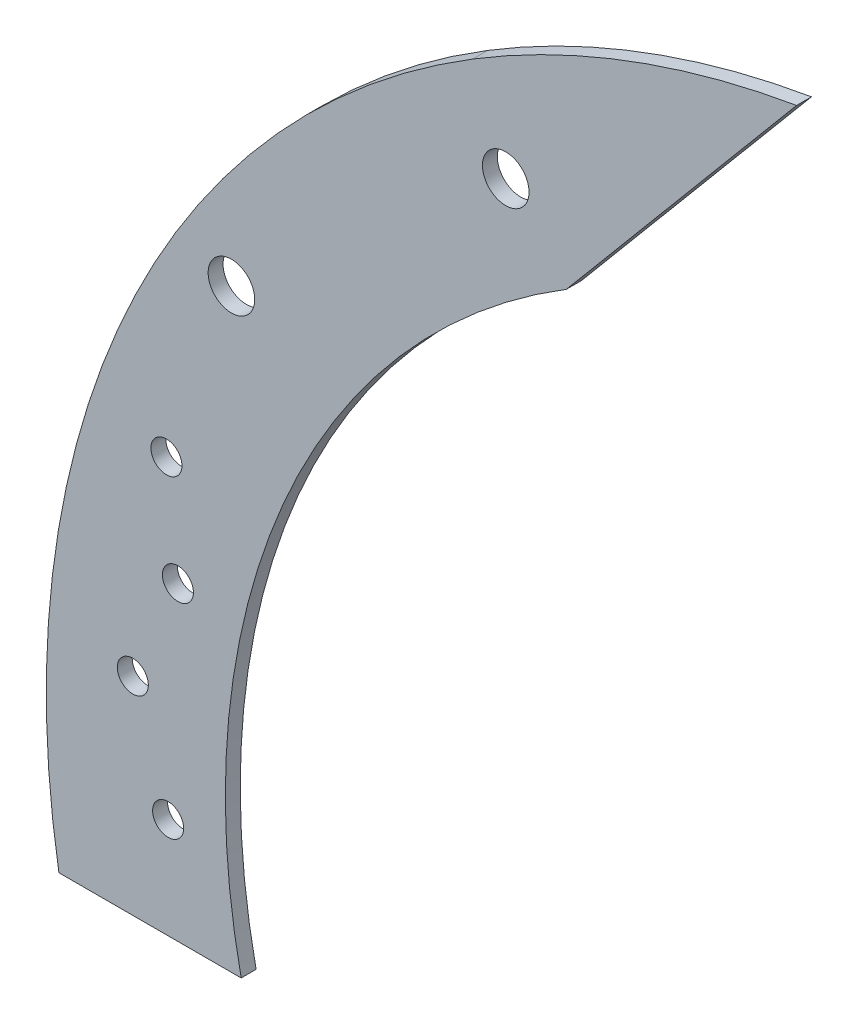
ISO-10303-21;
HEADER;
FILE_DESCRIPTION(('STEP AP214'),'2;1');
FILE_NAME('part.step','',(''),(''),'','','');
FILE_SCHEMA(('AUTOMOTIVE_DESIGN { 1 0 10303 214 1 1 1 1 }'));
ENDSEC;
DATA;
#1=APPLICATION_CONTEXT('core data for automotive mechanical design processes');
#2=APPLICATION_PROTOCOL_DEFINITION('international standard','automotive_design',2000,#1);
#3=PRODUCT_CONTEXT('',#1,'mechanical');
#4=PRODUCT('Part','Part','',(#3));
#5=PRODUCT_RELATED_PRODUCT_CATEGORY('part','',(#4));
#6=PRODUCT_DEFINITION_FORMATION('','',#4);
#7=PRODUCT_DEFINITION_CONTEXT('part definition',#1,'design');
#8=PRODUCT_DEFINITION('design','',#6,#7);
#9=PRODUCT_DEFINITION_SHAPE('','',#8);
#10=(LENGTH_UNIT() NAMED_UNIT(*) SI_UNIT(.MILLI.,.METRE.));
#11=(NAMED_UNIT(*) PLANE_ANGLE_UNIT() SI_UNIT($,.RADIAN.));
#12=(NAMED_UNIT(*) SI_UNIT($,.STERADIAN.) SOLID_ANGLE_UNIT());
#13=UNCERTAINTY_MEASURE_WITH_UNIT(LENGTH_MEASURE(1.E-05),#10,'distance_accuracy_value','');
#14=(GEOMETRIC_REPRESENTATION_CONTEXT(3) GLOBAL_UNCERTAINTY_ASSIGNED_CONTEXT((#13)) GLOBAL_UNIT_ASSIGNED_CONTEXT((#10,
#11,#12)) REPRESENTATION_CONTEXT('',''));
#15=CARTESIAN_POINT('',(0.,0.,0.));
#16=DIRECTION('',(0.,0.,1.));
#17=DIRECTION('',(1.,0.,0.));
#18=AXIS2_PLACEMENT_3D('',#15,#16,#17);
#19=CARTESIAN_POINT('',(-1.960372,-4.635754,3.175));
#20=DIRECTION('',(0.,0.,-1.));
#21=DIRECTION('',(-1.,0.,0.));
#22=AXIS2_PLACEMENT_3D('',#19,#20,#21);
#23=CYLINDRICAL_SURFACE('',#22,152.075409775388);
#24=CARTESIAN_POINT('',(-1.960372,-4.635754,0.));
#25=DIRECTION('',(0.,0.,-1.));
#26=DIRECTION('',(-1.,0.,0.));
#27=AXIS2_PLACEMENT_3D('',#24,#25,#26);
#28=CIRCLE('',#27,152.075409775388);
#29=CARTESIAN_POINT('',(-150.657390540399,-36.5125,0.));
#30=VERTEX_POINT('',#29);
#31=CARTESIAN_POINT('',(-81.4491978882218,125.011678744595,0.));
#32=VERTEX_POINT('',#31);
#33=EDGE_CURVE('E107',#30,#32,#28,.T.);
#34=ORIENTED_EDGE('',*,*,#33,.T.);
#35=DIRECTION('',(0.,0.,-1.));
#36=VECTOR('',#35,1.);
#37=CARTESIAN_POINT('',(-81.4491978882218,125.011678744595,3.175));
#38=LINE('',#37,#36);
#39=CARTESIAN_POINT('',(-81.4491978882218,125.011678744595,3.175));
#40=VERTEX_POINT('',#39);
#41=EDGE_CURVE('E11',#40,#32,#38,.T.);
#42=ORIENTED_EDGE('',*,*,#41,.F.);
#43=CARTESIAN_POINT('',(-1.960372,-4.635754,3.175));
#44=DIRECTION('',(0.,0.,-1.));
#45=DIRECTION('',(-1.,0.,0.));
#46=AXIS2_PLACEMENT_3D('',#43,#44,#45);
#47=CIRCLE('',#46,152.075409775388);
#48=CARTESIAN_POINT('',(-150.657390540399,-36.5125,3.175));
#49=VERTEX_POINT('',#48);
#50=EDGE_CURVE('E116',#49,#40,#47,.T.);
#51=ORIENTED_EDGE('',*,*,#50,.F.);
#52=DIRECTION('',(0.,0.,-1.));
#53=VECTOR('',#52,1.);
#54=CARTESIAN_POINT('',(-150.657390540399,-36.5125,3.175));
#55=LINE('',#54,#53);
#56=EDGE_CURVE('E103',#49,#30,#55,.T.);
#57=ORIENTED_EDGE('',*,*,#56,.T.);
#58=EDGE_LOOP('',(#34,#42,#51,#57));
#59=FACE_BOUND('',#58,.T.);
#60=ADVANCED_FACE('F33',(#59),#23,.F.);
#61=CARTESIAN_POINT('',(-81.4491978882218,125.011678744595,3.175));
#62=DIRECTION('',(-0.766044443118979,0.642787609686538,0.));
#63=DIRECTION('',(-0.642787609686538,-0.766044443118979,0.));
#64=AXIS2_PLACEMENT_3D('',#61,#62,#63);
#65=PLANE('',#64);
#66=DIRECTION('',(0.642787609686538,0.766044443118979,0.));
#67=VECTOR('',#66,1.);
#68=CARTESIAN_POINT('',(-81.4491978882218,125.011678744595,0.));
#69=LINE('',#68,#67);
#70=CARTESIAN_POINT('',(-32.4687820301075,183.384265310261,0.));
#71=VERTEX_POINT('',#70);
#72=EDGE_CURVE('E110',#32,#71,#69,.T.);
#73=ORIENTED_EDGE('',*,*,#72,.T.);
#74=DIRECTION('',(0.,0.,-1.));
#75=VECTOR('',#74,1.);
#76=CARTESIAN_POINT('',(-32.4687820301075,183.384265310261,3.175));
#77=LINE('',#76,#75);
#78=CARTESIAN_POINT('',(-32.4687820301075,183.384265310261,3.175));
#79=VERTEX_POINT('',#78);
#80=EDGE_CURVE('E41',#79,#71,#77,.T.);
#81=ORIENTED_EDGE('',*,*,#80,.F.);
#82=DIRECTION('',(0.642787609686538,0.766044443118979,0.));
#83=VECTOR('',#82,1.);
#84=CARTESIAN_POINT('',(-81.4491978882218,125.011678744595,3.175));
#85=LINE('',#84,#83);
#86=EDGE_CURVE('E83',#40,#79,#85,.T.);
#87=ORIENTED_EDGE('',*,*,#86,.F.);
#88=ORIENTED_EDGE('',*,*,#41,.T.);
#89=EDGE_LOOP('',(#73,#81,#87,#88));
#90=FACE_BOUND('',#89,.T.);
#91=ADVANCED_FACE('F137',(#90),#65,.F.);
#92=CARTESIAN_POINT('',(0.207299060866632,-8.17125707147935,3.175));
#93=DIRECTION('',(0.,0.,-1.));
#94=DIRECTION('',(-1.,0.,0.));
#95=AXIS2_PLACEMENT_3D('',#92,#93,#94);
#96=CYLINDRICAL_SURFACE('',#95,194.32252682179);
#97=CARTESIAN_POINT('',(0.207299060866632,-8.17125707147935,0.));
#98=DIRECTION('',(0.,0.,1.));
#99=DIRECTION('',(-1.,0.,0.));
#100=AXIS2_PLACEMENT_3D('',#97,#98,#99);
#101=CIRCLE('',#100,194.32252682179);
#102=CARTESIAN_POINT('',(-101.363819659176,157.49271690103,0.));
#103=VERTEX_POINT('',#102);
#104=EDGE_CURVE('E98',#71,#103,#101,.T.);
#105=ORIENTED_EDGE('',*,*,#104,.T.);
#106=DIRECTION('',(0.,0.,-1.));
#107=VECTOR('',#106,1.);
#108=CARTESIAN_POINT('',(-101.363819659176,157.49271690103,3.175));
#109=LINE('',#108,#107);
#110=CARTESIAN_POINT('',(-101.363819659176,157.49271690103,3.175));
#111=VERTEX_POINT('',#110);
#112=EDGE_CURVE('E95',#111,#103,#109,.T.);
#113=ORIENTED_EDGE('',*,*,#112,.F.);
#114=CARTESIAN_POINT('',(0.207299060866632,-8.17125707147935,3.175));
#115=DIRECTION('',(0.,0.,1.));
#116=DIRECTION('',(-1.,0.,0.));
#117=AXIS2_PLACEMENT_3D('',#114,#115,#116);
#118=CIRCLE('',#117,194.32252682179);
#119=EDGE_CURVE('E87',#79,#111,#118,.T.);
#120=ORIENTED_EDGE('',*,*,#119,.F.);
#121=ORIENTED_EDGE('',*,*,#80,.T.);
#122=EDGE_LOOP('',(#105,#113,#120,#121));
#123=FACE_BOUND('',#122,.T.);
#124=ADVANCED_FACE('F96',(#123),#96,.T.);
#125=CARTESIAN_POINT('',(-1.960372,-4.635754,3.175));
#126=DIRECTION('',(0.,0.,-1.));
#127=DIRECTION('',(-1.,0.,0.));
#128=AXIS2_PLACEMENT_3D('',#125,#126,#127);
#129=CYLINDRICAL_SURFACE('',#128,190.175409775388);
#130=CARTESIAN_POINT('',(-1.960372,-4.635754,0.));
#131=DIRECTION('',(0.,0.,1.));
#132=DIRECTION('',(-1.,0.,0.));
#133=AXIS2_PLACEMENT_3D('',#130,#131,#132);
#134=CIRCLE('',#133,190.175409775388);
#135=CARTESIAN_POINT('',(-189.445196846408,-36.5125,0.));
#136=VERTEX_POINT('',#135);
#137=EDGE_CURVE('E69',#103,#136,#134,.T.);
#138=ORIENTED_EDGE('',*,*,#137,.T.);
#139=DIRECTION('',(0.,0.,-1.));
#140=VECTOR('',#139,1.);
#141=CARTESIAN_POINT('',(-189.445196846408,-36.5125,3.175));
#142=LINE('',#141,#140);
#143=CARTESIAN_POINT('',(-189.445196846408,-36.5125,3.175));
#144=VERTEX_POINT('',#143);
#145=EDGE_CURVE('E99',#144,#136,#142,.T.);
#146=ORIENTED_EDGE('',*,*,#145,.F.);
#147=CARTESIAN_POINT('',(-1.960372,-4.635754,3.175));
#148=DIRECTION('',(0.,0.,1.));
#149=DIRECTION('',(-1.,0.,0.));
#150=AXIS2_PLACEMENT_3D('',#147,#148,#149);
#151=CIRCLE('',#150,190.175409775388);
#152=EDGE_CURVE('E91',#111,#144,#151,.T.);
#153=ORIENTED_EDGE('',*,*,#152,.F.);
#154=ORIENTED_EDGE('',*,*,#112,.T.);
#155=EDGE_LOOP('',(#138,#146,#153,#154));
#156=FACE_BOUND('',#155,.T.);
#157=ADVANCED_FACE('F101',(#156),#129,.T.);
#158=CARTESIAN_POINT('',(-150.657390540399,-36.5125,3.175));
#159=DIRECTION('',(0.,1.,0.));
#160=DIRECTION('',(0.,0.,1.));
#161=AXIS2_PLACEMENT_3D('',#158,#159,#160);
#162=PLANE('',#161);
#163=DIRECTION('',(1.,0.,0.));
#164=VECTOR('',#163,1.);
#165=CARTESIAN_POINT('',(-150.657390540399,-36.5125,0.));
#166=LINE('',#165,#164);
#167=EDGE_CURVE('E75',#136,#30,#166,.T.);
#168=ORIENTED_EDGE('',*,*,#167,.T.);
#169=ORIENTED_EDGE('',*,*,#56,.F.);
#170=DIRECTION('',(1.,0.,0.));
#171=VECTOR('',#170,1.);
#172=CARTESIAN_POINT('',(-150.657390540399,-36.5125,3.175));
#173=LINE('',#172,#171);
#174=EDGE_CURVE('E49',#144,#49,#173,.T.);
#175=ORIENTED_EDGE('',*,*,#174,.F.);
#176=ORIENTED_EDGE('',*,*,#145,.T.);
#177=EDGE_LOOP('',(#168,#169,#175,#176));
#178=FACE_BOUND('',#177,.T.);
#179=ADVANCED_FACE('F124',(#178),#162,.F.);
#180=CARTESIAN_POINT('',(-1.960372,-4.635754,3.175));
#181=DIRECTION('',(0.,0.,-1.));
#182=DIRECTION('',(-1.,0.,0.));
#183=AXIS2_PLACEMENT_3D('',#180,#181,#182);
#184=PLANE('',#183);
#185=CARTESIAN_POINT('',(-94.3609261196445,138.934265310261,3.175));
#186=DIRECTION('',(0.,0.,1.));
#187=DIRECTION('',(1.,0.,0.));
#188=AXIS2_PLACEMENT_3D('',#185,#186,#187);
#189=CIRCLE('',#188,4.96100099999999);
#190=CARTESIAN_POINT('',(-89.3999251196445,138.934265310261,3.175));
#191=VERTEX_POINT('',#190);
#192=EDGE_CURVE('E234',#191,#191,#189,.T.);
#193=ORIENTED_EDGE('',*,*,#192,.F.);
#194=EDGE_LOOP('',(#193));
#195=FACE_BOUND('',#194,.T.);
#196=CARTESIAN_POINT('',(-152.73351268531,89.9538494521462,3.175));
#197=DIRECTION('',(0.,0.,1.));
#198=DIRECTION('',(1.,0.,0.));
#199=AXIS2_PLACEMENT_3D('',#196,#197,#198);
#200=CIRCLE('',#199,4.96100099999999);
#201=CARTESIAN_POINT('',(-147.77251168531,89.9538494521462,3.175));
#202=VERTEX_POINT('',#201);
#203=EDGE_CURVE('E236',#202,#202,#200,.T.);
#204=ORIENTED_EDGE('',*,*,#203,.F.);
#205=EDGE_LOOP('',(#204));
#206=FACE_BOUND('',#205,.T.);
#207=CARTESIAN_POINT('',(-173.718655591782,7.57955745237717,3.175));
#208=DIRECTION('',(0.,0.,1.));
#209=DIRECTION('',(1.,0.,0.));
#210=AXIS2_PLACEMENT_3D('',#207,#208,#209);
#211=CIRCLE('',#210,3.30200000000001);
#212=CARTESIAN_POINT('',(-170.416655591782,7.57955745237717,3.175));
#213=VERTEX_POINT('',#212);
#214=EDGE_CURVE('E247',#213,#213,#211,.T.);
#215=ORIENTED_EDGE('',*,*,#214,.F.);
#216=EDGE_LOOP('',(#215));
#217=FACE_BOUND('',#216,.T.);
#218=CARTESIAN_POINT('',(-166.564839950697,51.569288406563,3.175));
#219=DIRECTION('',(0.,0.,1.));
#220=DIRECTION('',(1.,0.,0.));
#221=AXIS2_PLACEMENT_3D('',#218,#219,#220);
#222=CIRCLE('',#221,3.30200000000011);
#223=CARTESIAN_POINT('',(-163.262839950696,51.569288406563,3.175));
#224=VERTEX_POINT('',#223);
#225=EDGE_CURVE('E250',#224,#224,#222,.T.);
#226=ORIENTED_EDGE('',*,*,#225,.F.);
#227=EDGE_LOOP('',(#226));
#228=FACE_BOUND('',#227,.T.);
#229=CARTESIAN_POINT('',(-164.125827505257,29.4335038147387,3.175));
#230=DIRECTION('',(0.,0.,1.));
#231=DIRECTION('',(1.,0.,0.));
#232=AXIS2_PLACEMENT_3D('',#229,#230,#231);
#233=CIRCLE('',#232,3.30200000000004);
#234=CARTESIAN_POINT('',(-160.823827505257,29.4335038147387,3.175));
#235=VERTEX_POINT('',#234);
#236=EDGE_CURVE('E256',#235,#235,#233,.T.);
#237=ORIENTED_EDGE('',*,*,#236,.F.);
#238=EDGE_LOOP('',(#237));
#239=FACE_BOUND('',#238,.T.);
#240=CARTESIAN_POINT('',(-166.205357893552,-15.0736471775281,3.175));
#241=DIRECTION('',(0.,0.,1.));
#242=DIRECTION('',(1.,0.,0.));
#243=AXIS2_PLACEMENT_3D('',#240,#241,#242);
#244=CIRCLE('',#243,3.30200000000004);
#245=CARTESIAN_POINT('',(-162.903357893552,-15.0736471775281,3.175));
#246=VERTEX_POINT('',#245);
#247=EDGE_CURVE('E262',#246,#246,#244,.T.);
#248=ORIENTED_EDGE('',*,*,#247,.F.);
#249=EDGE_LOOP('',(#248));
#250=FACE_BOUND('',#249,.T.);
#251=ORIENTED_EDGE('',*,*,#50,.T.);
#252=ORIENTED_EDGE('',*,*,#86,.T.);
#253=ORIENTED_EDGE('',*,*,#119,.T.);
#254=ORIENTED_EDGE('',*,*,#152,.T.);
#255=ORIENTED_EDGE('',*,*,#174,.T.);
#256=EDGE_LOOP('',(#251,#252,#253,#254,#255));
#257=FACE_BOUND('',#256,.T.);
#258=ADVANCED_FACE('F89',(#195,#206,#217,#228,#239,#250,#257),#184,.F.);
#259=CARTESIAN_POINT('',(-1.960372,-4.635754,0.));
#260=DIRECTION('',(0.,0.,-1.));
#261=DIRECTION('',(-1.,0.,0.));
#262=AXIS2_PLACEMENT_3D('',#259,#260,#261);
#263=PLANE('',#262);
#264=CARTESIAN_POINT('',(-94.3609261196445,138.934265310261,0.));
#265=DIRECTION('',(0.,0.,1.));
#266=DIRECTION('',(1.,0.,0.));
#267=AXIS2_PLACEMENT_3D('',#264,#265,#266);
#268=CIRCLE('',#267,4.96100099999999);
#269=CARTESIAN_POINT('',(-89.3999251196445,138.934265310261,0.));
#270=VERTEX_POINT('',#269);
#271=EDGE_CURVE('E231',#270,#270,#268,.T.);
#272=ORIENTED_EDGE('',*,*,#271,.T.);
#273=EDGE_LOOP('',(#272));
#274=FACE_BOUND('',#273,.T.);
#275=CARTESIAN_POINT('',(-152.73351268531,89.9538494521462,0.));
#276=DIRECTION('',(0.,0.,1.));
#277=DIRECTION('',(1.,0.,0.));
#278=AXIS2_PLACEMENT_3D('',#275,#276,#277);
#279=CIRCLE('',#278,4.96100099999999);
#280=CARTESIAN_POINT('',(-147.77251168531,89.9538494521462,0.));
#281=VERTEX_POINT('',#280);
#282=EDGE_CURVE('E241',#281,#281,#279,.T.);
#283=ORIENTED_EDGE('',*,*,#282,.T.);
#284=EDGE_LOOP('',(#283));
#285=FACE_BOUND('',#284,.T.);
#286=CARTESIAN_POINT('',(-173.718655591782,7.57955745237717,0.));
#287=DIRECTION('',(0.,0.,-1.));
#288=DIRECTION('',(-1.,0.,0.));
#289=AXIS2_PLACEMENT_3D('',#286,#287,#288);
#290=CIRCLE('',#289,3.30200000000001);
#291=CARTESIAN_POINT('',(-177.020655591782,7.57955745237717,0.));
#292=VERTEX_POINT('',#291);
#293=EDGE_CURVE('E244',#292,#292,#290,.F.);
#294=ORIENTED_EDGE('',*,*,#293,.T.);
#295=EDGE_LOOP('',(#294));
#296=FACE_BOUND('',#295,.T.);
#297=CARTESIAN_POINT('',(-166.564839950697,51.569288406563,0.));
#298=DIRECTION('',(0.,0.,-1.));
#299=DIRECTION('',(-1.,0.,0.));
#300=AXIS2_PLACEMENT_3D('',#297,#298,#299);
#301=CIRCLE('',#300,3.30200000000011);
#302=CARTESIAN_POINT('',(-169.866839950697,51.569288406563,0.));
#303=VERTEX_POINT('',#302);
#304=EDGE_CURVE('E253',#303,#303,#301,.F.);
#305=ORIENTED_EDGE('',*,*,#304,.T.);
#306=EDGE_LOOP('',(#305));
#307=FACE_BOUND('',#306,.T.);
#308=CARTESIAN_POINT('',(-164.125827505257,29.4335038147387,0.));
#309=DIRECTION('',(0.,0.,-1.));
#310=DIRECTION('',(-1.,0.,0.));
#311=AXIS2_PLACEMENT_3D('',#308,#309,#310);
#312=CIRCLE('',#311,3.30200000000004);
#313=CARTESIAN_POINT('',(-167.427827505257,29.4335038147387,0.));
#314=VERTEX_POINT('',#313);
#315=EDGE_CURVE('E259',#314,#314,#312,.F.);
#316=ORIENTED_EDGE('',*,*,#315,.T.);
#317=EDGE_LOOP('',(#316));
#318=FACE_BOUND('',#317,.T.);
#319=CARTESIAN_POINT('',(-166.205357893552,-15.0736471775281,0.));
#320=DIRECTION('',(0.,0.,-1.));
#321=DIRECTION('',(-1.,0.,0.));
#322=AXIS2_PLACEMENT_3D('',#319,#320,#321);
#323=CIRCLE('',#322,3.30200000000004);
#324=CARTESIAN_POINT('',(-169.507357893552,-15.0736471775281,0.));
#325=VERTEX_POINT('',#324);
#326=EDGE_CURVE('E111',#325,#325,#323,.F.);
#327=ORIENTED_EDGE('',*,*,#326,.T.);
#328=EDGE_LOOP('',(#327));
#329=FACE_BOUND('',#328,.T.);
#330=ORIENTED_EDGE('',*,*,#33,.F.);
#331=ORIENTED_EDGE('',*,*,#167,.F.);
#332=ORIENTED_EDGE('',*,*,#137,.F.);
#333=ORIENTED_EDGE('',*,*,#104,.F.);
#334=ORIENTED_EDGE('',*,*,#72,.F.);
#335=EDGE_LOOP('',(#330,#331,#332,#333,#334));
#336=FACE_BOUND('',#335,.T.);
#337=ADVANCED_FACE('F120',(#274,#285,#296,#307,#318,#329,#336),#263,.T.);
#338=CARTESIAN_POINT('',(-166.205357893552,-15.0736471775281,-9.33946636591202));
#339=DIRECTION('',(0.,0.,1.));
#340=DIRECTION('',(1.,0.,0.));
#341=AXIS2_PLACEMENT_3D('',#338,#339,#340);
#342=CYLINDRICAL_SURFACE('',#341,3.30200000000004);
#343=ORIENTED_EDGE('',*,*,#247,.T.);
#344=EDGE_LOOP('',(#343));
#345=FACE_BOUND('',#344,.T.);
#346=ORIENTED_EDGE('',*,*,#326,.F.);
#347=EDGE_LOOP('',(#346));
#348=FACE_BOUND('',#347,.T.);
#349=ADVANCED_FACE('F161',(#345,#348),#342,.F.);
#350=CARTESIAN_POINT('',(-164.125827505257,29.4335038147387,-9.33946636591202));
#351=DIRECTION('',(0.,0.,1.));
#352=DIRECTION('',(1.,0.,0.));
#353=AXIS2_PLACEMENT_3D('',#350,#351,#352);
#354=CYLINDRICAL_SURFACE('',#353,3.30200000000004);
#355=ORIENTED_EDGE('',*,*,#236,.T.);
#356=EDGE_LOOP('',(#355));
#357=FACE_BOUND('',#356,.T.);
#358=ORIENTED_EDGE('',*,*,#315,.F.);
#359=EDGE_LOOP('',(#358));
#360=FACE_BOUND('',#359,.T.);
#361=ADVANCED_FACE('F166',(#357,#360),#354,.F.);
#362=CARTESIAN_POINT('',(-166.564839950697,51.569288406563,-9.33946636591222));
#363=DIRECTION('',(0.,0.,1.));
#364=DIRECTION('',(1.,0.,0.));
#365=AXIS2_PLACEMENT_3D('',#362,#363,#364);
#366=CYLINDRICAL_SURFACE('',#365,3.30200000000011);
#367=ORIENTED_EDGE('',*,*,#225,.T.);
#368=EDGE_LOOP('',(#367));
#369=FACE_BOUND('',#368,.T.);
#370=ORIENTED_EDGE('',*,*,#304,.F.);
#371=EDGE_LOOP('',(#370));
#372=FACE_BOUND('',#371,.T.);
#373=ADVANCED_FACE('F178',(#369,#372),#366,.F.);
#374=CARTESIAN_POINT('',(-173.718655591782,7.57955745237717,-9.33946636591222));
#375=DIRECTION('',(0.,0.,1.));
#376=DIRECTION('',(1.,0.,0.));
#377=AXIS2_PLACEMENT_3D('',#374,#375,#376);
#378=CYLINDRICAL_SURFACE('',#377,3.30200000000001);
#379=ORIENTED_EDGE('',*,*,#214,.T.);
#380=EDGE_LOOP('',(#379));
#381=FACE_BOUND('',#380,.T.);
#382=ORIENTED_EDGE('',*,*,#293,.F.);
#383=EDGE_LOOP('',(#382));
#384=FACE_BOUND('',#383,.T.);
#385=ADVANCED_FACE('F188',(#381,#384),#378,.F.);
#386=CARTESIAN_POINT('',(-152.73351268531,89.9538494521462,3.175));
#387=DIRECTION('',(0.,0.,1.));
#388=DIRECTION('',(1.,0.,0.));
#389=AXIS2_PLACEMENT_3D('',#386,#387,#388);
#390=CYLINDRICAL_SURFACE('',#389,4.96100099999999);
#391=ORIENTED_EDGE('',*,*,#282,.F.);
#392=EDGE_LOOP('',(#391));
#393=FACE_BOUND('',#392,.T.);
#394=ORIENTED_EDGE('',*,*,#203,.T.);
#395=EDGE_LOOP('',(#394));
#396=FACE_BOUND('',#395,.T.);
#397=ADVANCED_FACE('F197',(#393,#396),#390,.F.);
#398=CARTESIAN_POINT('',(-94.3609261196445,138.934265310261,3.175));
#399=DIRECTION('',(0.,0.,1.));
#400=DIRECTION('',(1.,0.,0.));
#401=AXIS2_PLACEMENT_3D('',#398,#399,#400);
#402=CYLINDRICAL_SURFACE('',#401,4.96100099999999);
#403=ORIENTED_EDGE('',*,*,#271,.F.);
#404=EDGE_LOOP('',(#403));
#405=FACE_BOUND('',#404,.T.);
#406=ORIENTED_EDGE('',*,*,#192,.T.);
#407=EDGE_LOOP('',(#406));
#408=FACE_BOUND('',#407,.T.);
#409=ADVANCED_FACE('F214',(#405,#408),#402,.F.);
#410=CLOSED_SHELL('',(#60,#91,#124,#157,#179,#258,#337,#349,#361,#373,#385,#397,#409));
#411=MANIFOLD_SOLID_BREP('B2',#410);
#412=ADVANCED_BREP_SHAPE_REPRESENTATION('',(#18,#411),#14);
#413=SHAPE_DEFINITION_REPRESENTATION(#9,#412);
ENDSEC;
END-ISO-10303-21;
